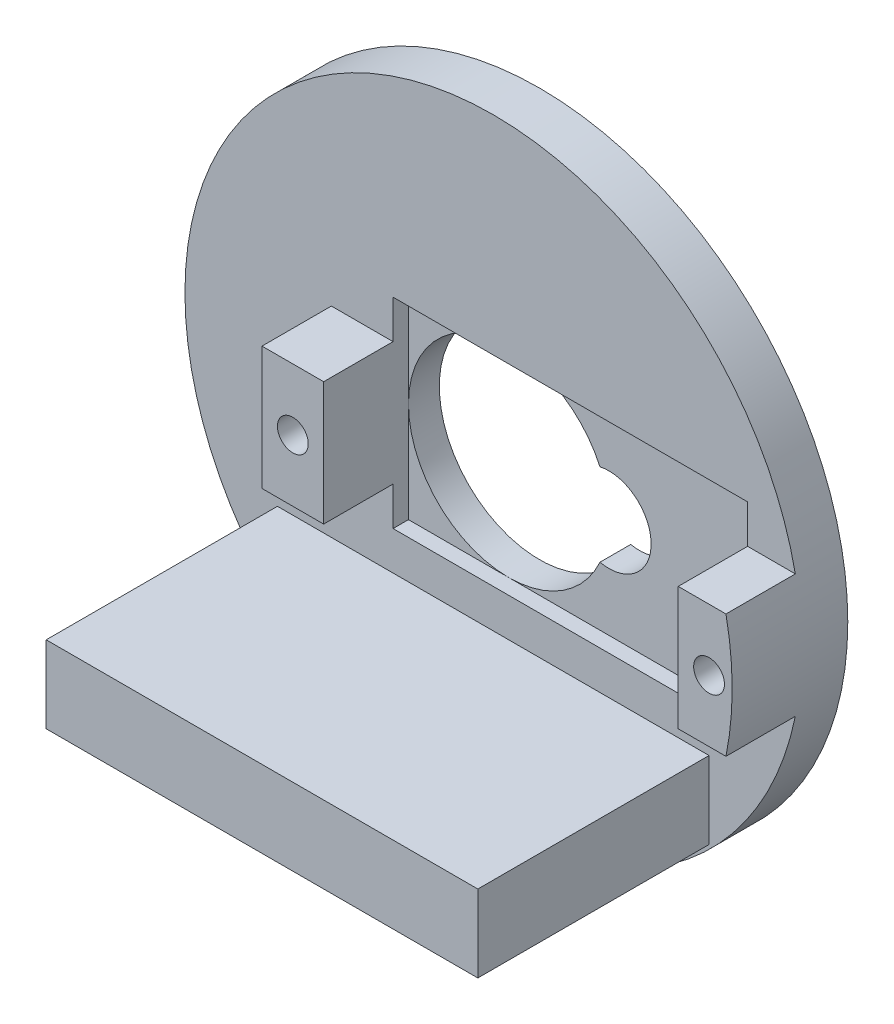
ISO-10303-21;
HEADER;
FILE_DESCRIPTION(('STEP AP214'),'2;1');
FILE_NAME('part.step','',(''),(''),'','','');
FILE_SCHEMA(('AUTOMOTIVE_DESIGN { 1 0 10303 214 1 1 1 1 }'));
ENDSEC;
DATA;
#1=APPLICATION_CONTEXT('core data for automotive mechanical design processes');
#2=APPLICATION_PROTOCOL_DEFINITION('international standard','automotive_design',2000,#1);
#3=PRODUCT_CONTEXT('',#1,'mechanical');
#4=PRODUCT('Part','Part','',(#3));
#5=PRODUCT_RELATED_PRODUCT_CATEGORY('part','',(#4));
#6=PRODUCT_DEFINITION_FORMATION('','',#4);
#7=PRODUCT_DEFINITION_CONTEXT('part definition',#1,'design');
#8=PRODUCT_DEFINITION('design','',#6,#7);
#9=PRODUCT_DEFINITION_SHAPE('','',#8);
#10=(LENGTH_UNIT() NAMED_UNIT(*) SI_UNIT(.MILLI.,.METRE.));
#11=(NAMED_UNIT(*) PLANE_ANGLE_UNIT() SI_UNIT($,.RADIAN.));
#12=(NAMED_UNIT(*) SI_UNIT($,.STERADIAN.) SOLID_ANGLE_UNIT());
#13=UNCERTAINTY_MEASURE_WITH_UNIT(LENGTH_MEASURE(1.E-05),#10,'distance_accuracy_value','');
#14=(GEOMETRIC_REPRESENTATION_CONTEXT(3) GLOBAL_UNCERTAINTY_ASSIGNED_CONTEXT((#13)) GLOBAL_UNIT_ASSIGNED_CONTEXT((#10,
#11,#12)) REPRESENTATION_CONTEXT('',''));
#15=CARTESIAN_POINT('',(0.,0.,0.));
#16=DIRECTION('',(0.,0.,1.));
#17=DIRECTION('',(1.,0.,0.));
#18=AXIS2_PLACEMENT_3D('',#15,#16,#17);
#19=CARTESIAN_POINT('',(0.,0.,3.));
#20=DIRECTION('',(0.,0.,1.));
#21=DIRECTION('',(1.,0.,0.));
#22=AXIS2_PLACEMENT_3D('',#19,#20,#21);
#23=PLANE('',#22);
#24=DIRECTION('',(0.,1.,0.));
#25=VECTOR('',#24,1.);
#26=CARTESIAN_POINT('',(16.5,-6.5,3.));
#27=LINE('',#26,#25);
#28=CARTESIAN_POINT('',(16.5,-6.5,3.));
#29=VERTEX_POINT('',#28);
#30=CARTESIAN_POINT('',(16.5,-4.,3.));
#31=VERTEX_POINT('',#30);
#32=EDGE_CURVE('E193',#29,#31,#27,.T.);
#33=ORIENTED_EDGE('',*,*,#32,.F.);
#34=DIRECTION('',(1.,0.,0.));
#35=VECTOR('',#34,1.);
#36=CARTESIAN_POINT('',(-6.5,-6.5,3.));
#37=LINE('',#36,#35);
#38=CARTESIAN_POINT('',(-6.5,-6.5,3.));
#39=VERTEX_POINT('',#38);
#40=EDGE_CURVE('E202',#39,#29,#37,.T.);
#41=ORIENTED_EDGE('',*,*,#40,.F.);
#42=DIRECTION('',(0.,-1.,0.));
#43=VECTOR('',#42,1.);
#44=CARTESIAN_POINT('',(-6.5,-6.5,3.));
#45=LINE('',#44,#43);
#46=CARTESIAN_POINT('',(-6.5,-4.,3.));
#47=VERTEX_POINT('',#46);
#48=EDGE_CURVE('E215',#47,#39,#45,.T.);
#49=ORIENTED_EDGE('',*,*,#48,.F.);
#50=DIRECTION('',(1.,0.,0.));
#51=VECTOR('',#50,1.);
#52=CARTESIAN_POINT('',(-10.5,-4.,3.));
#53=LINE('',#52,#51);
#54=CARTESIAN_POINT('',(-10.5,-4.,3.));
#55=VERTEX_POINT('',#54);
#56=EDGE_CURVE('E273',#55,#47,#53,.T.);
#57=ORIENTED_EDGE('',*,*,#56,.F.);
#58=DIRECTION('',(0.,-1.,0.));
#59=VECTOR('',#58,1.);
#60=CARTESIAN_POINT('',(-10.5,-4.,3.));
#61=LINE('',#60,#59);
#62=CARTESIAN_POINT('',(-10.5,4.,3.));
#63=VERTEX_POINT('',#62);
#64=EDGE_CURVE('E282',#63,#55,#61,.T.);
#65=ORIENTED_EDGE('',*,*,#64,.F.);
#66=DIRECTION('',(-1.,0.,0.));
#67=VECTOR('',#66,1.);
#68=CARTESIAN_POINT('',(-10.5,4.,3.));
#69=LINE('',#68,#67);
#70=CARTESIAN_POINT('',(-6.50000000000001,4.,3.));
#71=VERTEX_POINT('',#70);
#72=EDGE_CURVE('E266',#71,#63,#69,.T.);
#73=ORIENTED_EDGE('',*,*,#72,.F.);
#74=CARTESIAN_POINT('',(-6.50000000000001,6.5,3.));
#75=VERTEX_POINT('',#74);
#76=EDGE_CURVE('E216',#75,#71,#45,.T.);
#77=ORIENTED_EDGE('',*,*,#76,.F.);
#78=DIRECTION('',(-1.,0.,0.));
#79=VECTOR('',#78,1.);
#80=CARTESIAN_POINT('',(-6.50000000000001,6.5,3.));
#81=LINE('',#80,#79);
#82=CARTESIAN_POINT('',(16.5,6.5,3.));
#83=VERTEX_POINT('',#82);
#84=EDGE_CURVE('E213',#83,#75,#81,.T.);
#85=ORIENTED_EDGE('',*,*,#84,.F.);
#86=CARTESIAN_POINT('',(16.5,4.,3.));
#87=VERTEX_POINT('',#86);
#88=EDGE_CURVE('E191',#87,#83,#27,.T.);
#89=ORIENTED_EDGE('',*,*,#88,.F.);
#90=DIRECTION('',(-1.,0.,0.));
#91=VECTOR('',#90,1.);
#92=CARTESIAN_POINT('',(16.5,4.,3.));
#93=LINE('',#92,#91);
#94=CARTESIAN_POINT('',(19.5959179422654,4.,3.));
#95=VERTEX_POINT('',#94);
#96=EDGE_CURVE('E235',#95,#87,#93,.T.);
#97=ORIENTED_EDGE('',*,*,#96,.F.);
#98=CARTESIAN_POINT('',(0.,0.,3.));
#99=DIRECTION('',(0.,0.,1.));
#100=DIRECTION('',(1.,0.,0.));
#101=AXIS2_PLACEMENT_3D('',#98,#99,#100);
#102=CIRCLE('',#101,20.);
#103=CARTESIAN_POINT('',(19.5959179422654,-4.,3.));
#104=VERTEX_POINT('',#103);
#105=EDGE_CURVE('E309',#95,#104,#102,.T.);
#106=ORIENTED_EDGE('',*,*,#105,.T.);
#107=DIRECTION('',(1.,0.,0.));
#108=VECTOR('',#107,1.);
#109=CARTESIAN_POINT('',(16.5,-4.,3.));
#110=LINE('',#109,#108);
#111=EDGE_CURVE('E240',#31,#104,#110,.T.);
#112=ORIENTED_EDGE('',*,*,#111,.F.);
#113=EDGE_LOOP('',(#33,#41,#49,#57,#65,#73,#77,#85,#89,#97,#106,#112));
#114=FACE_BOUND('',#113,.T.);
#115=DIRECTION('',(-1.,0.,0.));
#116=VECTOR('',#115,1.);
#117=CARTESIAN_POINT('',(-14.,-9.,3.));
#118=LINE('',#117,#116);
#119=CARTESIAN_POINT('',(14.,-9.,3.));
#120=VERTEX_POINT('',#119);
#121=CARTESIAN_POINT('',(-14.,-9.,3.));
#122=VERTEX_POINT('',#121);
#123=EDGE_CURVE('E618',#120,#122,#118,.T.);
#124=ORIENTED_EDGE('',*,*,#123,.F.);
#125=DIRECTION('',(0.,1.,0.));
#126=VECTOR('',#125,1.);
#127=CARTESIAN_POINT('',(14.,-14.,3.));
#128=LINE('',#127,#126);
#129=CARTESIAN_POINT('',(14.,-14.,3.));
#130=VERTEX_POINT('',#129);
#131=EDGE_CURVE('E189',#130,#120,#128,.T.);
#132=ORIENTED_EDGE('',*,*,#131,.F.);
#133=DIRECTION('',(1.,0.,0.));
#134=VECTOR('',#133,1.);
#135=CARTESIAN_POINT('',(-14.,-14.,3.));
#136=LINE('',#135,#134);
#137=CARTESIAN_POINT('',(-14.,-14.,3.));
#138=VERTEX_POINT('',#137);
#139=EDGE_CURVE('E185',#138,#130,#136,.T.);
#140=ORIENTED_EDGE('',*,*,#139,.F.);
#141=DIRECTION('',(0.,-1.,0.));
#142=VECTOR('',#141,1.);
#143=CARTESIAN_POINT('',(-14.,-14.,3.));
#144=LINE('',#143,#142);
#145=EDGE_CURVE('E615',#122,#138,#144,.T.);
#146=ORIENTED_EDGE('',*,*,#145,.F.);
#147=EDGE_LOOP('',(#124,#132,#140,#146));
#148=FACE_BOUND('',#147,.T.);
#149=ADVANCED_FACE('F32',(#114,#148),#23,.T.);
#150=CARTESIAN_POINT('',(0.,0.,3.));
#151=DIRECTION('',(0.,0.,-1.));
#152=DIRECTION('',(-1.,0.,0.));
#153=AXIS2_PLACEMENT_3D('',#150,#151,#152);
#154=CYLINDRICAL_SURFACE('',#153,6.5);
#155=CARTESIAN_POINT('',(0.,0.,2.));
#156=DIRECTION('',(0.,0.,-1.));
#157=DIRECTION('',(-1.,0.,0.));
#158=AXIS2_PLACEMENT_3D('',#155,#156,#157);
#159=CIRCLE('',#158,6.5);
#160=CARTESIAN_POINT('',(0.,6.5,2.));
#161=VERTEX_POINT('',#160);
#162=CARTESIAN_POINT('',(5.9213890224145,2.6808864290061,2.));
#163=VERTEX_POINT('',#162);
#164=EDGE_CURVE('E11',#161,#163,#159,.T.);
#165=ORIENTED_EDGE('',*,*,#164,.F.);
#166=CARTESIAN_POINT('',(-6.5,0.,2.));
#167=VERTEX_POINT('',#166);
#168=EDGE_CURVE('E41',#167,#161,#159,.T.);
#169=ORIENTED_EDGE('',*,*,#168,.F.);
#170=CARTESIAN_POINT('',(0.,-6.5,2.));
#171=VERTEX_POINT('',#170);
#172=EDGE_CURVE('E36',#171,#167,#159,.T.);
#173=ORIENTED_EDGE('',*,*,#172,.F.);
#174=CARTESIAN_POINT('',(5.9213890224145,-2.6808864290061,2.));
#175=VERTEX_POINT('',#174);
#176=EDGE_CURVE('E316',#175,#171,#159,.T.);
#177=ORIENTED_EDGE('',*,*,#176,.F.);
#178=DIRECTION('',(0.,0.,-1.));
#179=VECTOR('',#178,1.);
#180=CARTESIAN_POINT('',(5.9213890224145,-2.6808864290061,3.));
#181=LINE('',#180,#179);
#182=CARTESIAN_POINT('',(5.9213890224145,-2.6808864290061,0.));
#183=VERTEX_POINT('',#182);
#184=EDGE_CURVE('E304',#175,#183,#181,.T.);
#185=ORIENTED_EDGE('',*,*,#184,.T.);
#186=CARTESIAN_POINT('',(0.,0.,0.));
#187=DIRECTION('',(0.,0.,1.));
#188=DIRECTION('',(1.,0.,0.));
#189=AXIS2_PLACEMENT_3D('',#186,#187,#188);
#190=CIRCLE('',#189,6.5);
#191=CARTESIAN_POINT('',(5.9213890224145,2.6808864290061,0.));
#192=VERTEX_POINT('',#191);
#193=EDGE_CURVE('E301',#192,#183,#190,.T.);
#194=ORIENTED_EDGE('',*,*,#193,.F.);
#195=DIRECTION('',(0.,0.,-1.));
#196=VECTOR('',#195,1.);
#197=CARTESIAN_POINT('',(5.9213890224145,2.6808864290061,3.));
#198=LINE('',#197,#196);
#199=EDGE_CURVE('E306',#163,#192,#198,.T.);
#200=ORIENTED_EDGE('',*,*,#199,.F.);
#201=EDGE_LOOP('',(#165,#169,#173,#177,#185,#194,#200));
#202=FACE_BOUND('',#201,.T.);
#203=ADVANCED_FACE('F337',(#202),#154,.F.);
#204=CARTESIAN_POINT('',(0.,0.,0.));
#205=DIRECTION('',(0.,0.,1.));
#206=DIRECTION('',(1.,0.,0.));
#207=AXIS2_PLACEMENT_3D('',#204,#205,#206);
#208=PLANE('',#207);
#209=CARTESIAN_POINT('',(0.,0.,0.));
#210=DIRECTION('',(0.,0.,1.));
#211=DIRECTION('',(1.,0.,0.));
#212=AXIS2_PLACEMENT_3D('',#209,#210,#211);
#213=CIRCLE('',#212,20.);
#214=CARTESIAN_POINT('',(20.,0.,0.));
#215=VERTEX_POINT('',#214);
#216=EDGE_CURVE('E308',#215,#215,#213,.T.);
#217=ORIENTED_EDGE('',*,*,#216,.F.);
#218=EDGE_LOOP('',(#217));
#219=FACE_BOUND('',#218,.T.);
#220=CARTESIAN_POINT('',(6.5,0.,0.));
#221=DIRECTION('',(0.,0.,1.));
#222=DIRECTION('',(1.,0.,0.));
#223=AXIS2_PLACEMENT_3D('',#220,#221,#222);
#224=CIRCLE('',#223,2.74261603375527);
#225=EDGE_CURVE('E298',#183,#192,#224,.T.);
#226=ORIENTED_EDGE('',*,*,#225,.T.);
#227=ORIENTED_EDGE('',*,*,#193,.T.);
#228=EDGE_LOOP('',(#226,#227));
#229=FACE_BOUND('',#228,.T.);
#230=ADVANCED_FACE('F344',(#219,#229),#208,.F.);
#231=CARTESIAN_POINT('',(0.,0.,3.));
#232=DIRECTION('',(0.,0.,-1.));
#233=DIRECTION('',(-1.,0.,0.));
#234=AXIS2_PLACEMENT_3D('',#231,#232,#233);
#235=CYLINDRICAL_SURFACE('',#234,20.);
#236=ORIENTED_EDGE('',*,*,#105,.F.);
#237=DIRECTION('',(0.,0.,-1.));
#238=VECTOR('',#237,1.);
#239=CARTESIAN_POINT('',(19.5959179422654,4.,7.5));
#240=LINE('',#239,#238);
#241=CARTESIAN_POINT('',(19.5959179422654,4.,7.5));
#242=VERTEX_POINT('',#241);
#243=EDGE_CURVE('E259',#242,#95,#240,.T.);
#244=ORIENTED_EDGE('',*,*,#243,.F.);
#245=CARTESIAN_POINT('',(0.,0.,7.5));
#246=DIRECTION('',(0.,0.,1.));
#247=DIRECTION('',(1.,0.,0.));
#248=AXIS2_PLACEMENT_3D('',#245,#246,#247);
#249=CIRCLE('',#248,20.);
#250=CARTESIAN_POINT('',(19.5959179422654,-4.,7.5));
#251=VERTEX_POINT('',#250);
#252=EDGE_CURVE('E236',#251,#242,#249,.T.);
#253=ORIENTED_EDGE('',*,*,#252,.F.);
#254=DIRECTION('',(0.,0.,-1.));
#255=VECTOR('',#254,1.);
#256=CARTESIAN_POINT('',(19.5959179422654,-4.,7.5));
#257=LINE('',#256,#255);
#258=EDGE_CURVE('E246',#251,#104,#257,.T.);
#259=ORIENTED_EDGE('',*,*,#258,.T.);
#260=EDGE_LOOP('',(#236,#244,#253,#259));
#261=FACE_BOUND('',#260,.T.);
#262=ORIENTED_EDGE('',*,*,#216,.T.);
#263=EDGE_LOOP('',(#262));
#264=FACE_BOUND('',#263,.T.);
#265=ADVANCED_FACE('F34',(#261,#264),#235,.T.);
#266=CARTESIAN_POINT('',(6.5,0.,3.));
#267=DIRECTION('',(0.,0.,-1.));
#268=DIRECTION('',(-1.,0.,0.));
#269=AXIS2_PLACEMENT_3D('',#266,#267,#268);
#270=CYLINDRICAL_SURFACE('',#269,2.74261603375527);
#271=CARTESIAN_POINT('',(6.5,0.,2.));
#272=DIRECTION('',(0.,0.,-1.));
#273=DIRECTION('',(-1.,0.,0.));
#274=AXIS2_PLACEMENT_3D('',#271,#272,#273);
#275=CIRCLE('',#274,2.74261603375527);
#276=EDGE_CURVE('E222',#163,#175,#275,.T.);
#277=ORIENTED_EDGE('',*,*,#276,.F.);
#278=ORIENTED_EDGE('',*,*,#199,.T.);
#279=ORIENTED_EDGE('',*,*,#225,.F.);
#280=ORIENTED_EDGE('',*,*,#184,.F.);
#281=EDGE_LOOP('',(#277,#278,#279,#280));
#282=FACE_BOUND('',#281,.T.);
#283=ADVANCED_FACE('F341',(#282),#270,.F.);
#284=CARTESIAN_POINT('',(0.,0.,7.5));
#285=DIRECTION('',(0.,0.,-1.));
#286=DIRECTION('',(-1.,0.,0.));
#287=AXIS2_PLACEMENT_3D('',#284,#285,#286);
#288=PLANE('',#287);
#289=DIRECTION('',(0.,1.,0.));
#290=VECTOR('',#289,1.);
#291=CARTESIAN_POINT('',(-6.5,-4.,7.5));
#292=LINE('',#291,#290);
#293=CARTESIAN_POINT('',(-6.5,-4.,7.5));
#294=VERTEX_POINT('',#293);
#295=CARTESIAN_POINT('',(-6.5,4.,7.5));
#296=VERTEX_POINT('',#295);
#297=EDGE_CURVE('E269',#294,#296,#292,.T.);
#298=ORIENTED_EDGE('',*,*,#297,.T.);
#299=DIRECTION('',(-1.,0.,0.));
#300=VECTOR('',#299,1.);
#301=CARTESIAN_POINT('',(-10.5,4.,7.5));
#302=LINE('',#301,#300);
#303=CARTESIAN_POINT('',(-10.5,4.,7.5));
#304=VERTEX_POINT('',#303);
#305=EDGE_CURVE('E272',#296,#304,#302,.T.);
#306=ORIENTED_EDGE('',*,*,#305,.T.);
#307=DIRECTION('',(0.,-1.,0.));
#308=VECTOR('',#307,1.);
#309=CARTESIAN_POINT('',(-10.5,-4.,7.5));
#310=LINE('',#309,#308);
#311=CARTESIAN_POINT('',(-10.5,-4.,7.5));
#312=VERTEX_POINT('',#311);
#313=EDGE_CURVE('E275',#304,#312,#310,.T.);
#314=ORIENTED_EDGE('',*,*,#313,.T.);
#315=DIRECTION('',(1.,0.,0.));
#316=VECTOR('',#315,1.);
#317=CARTESIAN_POINT('',(-10.5,-4.,7.5));
#318=LINE('',#317,#316);
#319=EDGE_CURVE('E277',#312,#294,#318,.T.);
#320=ORIENTED_EDGE('',*,*,#319,.T.);
#321=EDGE_LOOP('',(#298,#306,#314,#320));
#322=FACE_BOUND('',#321,.T.);
#323=CARTESIAN_POINT('',(-8.5,0.,7.5));
#324=DIRECTION('',(0.,0.,1.));
#325=DIRECTION('',(1.,0.,0.));
#326=AXIS2_PLACEMENT_3D('',#323,#324,#325);
#327=CIRCLE('',#326,1.);
#328=CARTESIAN_POINT('',(-7.5,0.,7.5));
#329=VERTEX_POINT('',#328);
#330=EDGE_CURVE('E263',#329,#329,#327,.T.);
#331=ORIENTED_EDGE('',*,*,#330,.F.);
#332=EDGE_LOOP('',(#331));
#333=FACE_BOUND('',#332,.T.);
#334=ADVANCED_FACE('F393',(#322,#333),#288,.F.);
#335=CARTESIAN_POINT('',(-6.5,-4.,7.5));
#336=DIRECTION('',(-1.,0.,0.));
#337=DIRECTION('',(0.,0.,1.));
#338=AXIS2_PLACEMENT_3D('',#335,#336,#337);
#339=PLANE('',#338);
#340=DIRECTION('',(0.,-1.,0.));
#341=VECTOR('',#340,1.);
#342=CARTESIAN_POINT('',(-6.5,-6.5,2.));
#343=LINE('',#342,#341);
#344=CARTESIAN_POINT('',(-6.5,-6.5,2.));
#345=VERTEX_POINT('',#344);
#346=EDGE_CURVE('E206',#167,#345,#343,.T.);
#347=ORIENTED_EDGE('',*,*,#346,.F.);
#348=CARTESIAN_POINT('',(-6.50000000000001,6.5,2.));
#349=VERTEX_POINT('',#348);
#350=EDGE_CURVE('E207',#349,#167,#343,.T.);
#351=ORIENTED_EDGE('',*,*,#350,.F.);
#352=DIRECTION('',(0.,0.,1.));
#353=VECTOR('',#352,1.);
#354=CARTESIAN_POINT('',(-6.50000000000001,6.5,2.));
#355=LINE('',#354,#353);
#356=EDGE_CURVE('E226',#349,#75,#355,.T.);
#357=ORIENTED_EDGE('',*,*,#356,.T.);
#358=ORIENTED_EDGE('',*,*,#76,.T.);
#359=DIRECTION('',(0.,0.,-1.));
#360=VECTOR('',#359,1.);
#361=CARTESIAN_POINT('',(-6.5,4.,7.5));
#362=LINE('',#361,#360);
#363=EDGE_CURVE('E295',#296,#71,#362,.T.);
#364=ORIENTED_EDGE('',*,*,#363,.F.);
#365=ORIENTED_EDGE('',*,*,#297,.F.);
#366=DIRECTION('',(0.,0.,-1.));
#367=VECTOR('',#366,1.);
#368=CARTESIAN_POINT('',(-6.5,-4.,7.5));
#369=LINE('',#368,#367);
#370=EDGE_CURVE('E279',#294,#47,#369,.T.);
#371=ORIENTED_EDGE('',*,*,#370,.T.);
#372=ORIENTED_EDGE('',*,*,#48,.T.);
#373=DIRECTION('',(0.,0.,1.));
#374=VECTOR('',#373,1.);
#375=CARTESIAN_POINT('',(-6.5,-6.5,2.));
#376=LINE('',#375,#374);
#377=EDGE_CURVE('E223',#345,#39,#376,.T.);
#378=ORIENTED_EDGE('',*,*,#377,.F.);
#379=EDGE_LOOP('',(#347,#351,#357,#358,#364,#365,#371,#372,#378));
#380=FACE_BOUND('',#379,.T.);
#381=ADVANCED_FACE('F395',(#380),#339,.F.);
#382=CARTESIAN_POINT('',(-10.5,4.,7.5));
#383=DIRECTION('',(0.,-1.,0.));
#384=DIRECTION('',(0.,0.,-1.));
#385=AXIS2_PLACEMENT_3D('',#382,#383,#384);
#386=PLANE('',#385);
#387=ORIENTED_EDGE('',*,*,#72,.T.);
#388=DIRECTION('',(0.,0.,-1.));
#389=VECTOR('',#388,1.);
#390=CARTESIAN_POINT('',(-10.5,4.,7.5));
#391=LINE('',#390,#389);
#392=EDGE_CURVE('E292',#304,#63,#391,.T.);
#393=ORIENTED_EDGE('',*,*,#392,.F.);
#394=ORIENTED_EDGE('',*,*,#305,.F.);
#395=ORIENTED_EDGE('',*,*,#363,.T.);
#396=EDGE_LOOP('',(#387,#393,#394,#395));
#397=FACE_BOUND('',#396,.T.);
#398=ADVANCED_FACE('F400',(#397),#386,.F.);
#399=CARTESIAN_POINT('',(-10.5,-4.,7.5));
#400=DIRECTION('',(1.,0.,0.));
#401=DIRECTION('',(0.,0.,-1.));
#402=AXIS2_PLACEMENT_3D('',#399,#400,#401);
#403=PLANE('',#402);
#404=ORIENTED_EDGE('',*,*,#64,.T.);
#405=DIRECTION('',(0.,0.,-1.));
#406=VECTOR('',#405,1.);
#407=CARTESIAN_POINT('',(-10.5,-4.,7.5));
#408=LINE('',#407,#406);
#409=EDGE_CURVE('E289',#312,#55,#408,.T.);
#410=ORIENTED_EDGE('',*,*,#409,.F.);
#411=ORIENTED_EDGE('',*,*,#313,.F.);
#412=ORIENTED_EDGE('',*,*,#392,.T.);
#413=EDGE_LOOP('',(#404,#410,#411,#412));
#414=FACE_BOUND('',#413,.T.);
#415=ADVANCED_FACE('F387',(#414),#403,.F.);
#416=CARTESIAN_POINT('',(-10.5,-4.,7.5));
#417=DIRECTION('',(0.,1.,0.));
#418=DIRECTION('',(0.,0.,1.));
#419=AXIS2_PLACEMENT_3D('',#416,#417,#418);
#420=PLANE('',#419);
#421=ORIENTED_EDGE('',*,*,#56,.T.);
#422=ORIENTED_EDGE('',*,*,#370,.F.);
#423=ORIENTED_EDGE('',*,*,#319,.F.);
#424=ORIENTED_EDGE('',*,*,#409,.T.);
#425=EDGE_LOOP('',(#421,#422,#423,#424));
#426=FACE_BOUND('',#425,.T.);
#427=ADVANCED_FACE('F379',(#426),#420,.F.);
#428=CARTESIAN_POINT('',(-8.5,0.,7.5));
#429=DIRECTION('',(0.,0.,-1.));
#430=DIRECTION('',(-1.,0.,0.));
#431=AXIS2_PLACEMENT_3D('',#428,#429,#430);
#432=CYLINDRICAL_SURFACE('',#431,1.);
#433=ORIENTED_EDGE('',*,*,#330,.T.);
#434=EDGE_LOOP('',(#433));
#435=FACE_BOUND('',#434,.T.);
#436=CARTESIAN_POINT('',(-8.5,0.,3.));
#437=DIRECTION('',(0.,0.,1.));
#438=DIRECTION('',(1.,0.,0.));
#439=AXIS2_PLACEMENT_3D('',#436,#437,#438);
#440=CIRCLE('',#439,1.);
#441=CARTESIAN_POINT('',(-7.5,0.,3.));
#442=VERTEX_POINT('',#441);
#443=EDGE_CURVE('E262',#442,#442,#440,.T.);
#444=ORIENTED_EDGE('',*,*,#443,.F.);
#445=EDGE_LOOP('',(#444));
#446=FACE_BOUND('',#445,.T.);
#447=ADVANCED_FACE('F370',(#435,#446),#432,.F.);
#448=ORIENTED_EDGE('',*,*,#443,.T.);
#449=EDGE_LOOP('',(#448));
#450=FACE_BOUND('',#449,.T.);
#451=ADVANCED_FACE('F358',(#450),#23,.T.);
#452=CARTESIAN_POINT('',(0.,0.,7.5));
#453=DIRECTION('',(0.,0.,1.));
#454=DIRECTION('',(1.,0.,0.));
#455=AXIS2_PLACEMENT_3D('',#452,#453,#454);
#456=PLANE('',#455);
#457=ORIENTED_EDGE('',*,*,#252,.T.);
#458=DIRECTION('',(-1.,0.,0.));
#459=VECTOR('',#458,1.);
#460=CARTESIAN_POINT('',(16.5,4.,7.5));
#461=LINE('',#460,#459);
#462=CARTESIAN_POINT('',(16.5,4.,7.5));
#463=VERTEX_POINT('',#462);
#464=EDGE_CURVE('E239',#242,#463,#461,.T.);
#465=ORIENTED_EDGE('',*,*,#464,.T.);
#466=DIRECTION('',(0.,-1.,0.));
#467=VECTOR('',#466,1.);
#468=CARTESIAN_POINT('',(16.5,-4.,7.5));
#469=LINE('',#468,#467);
#470=CARTESIAN_POINT('',(16.5,-4.,7.5));
#471=VERTEX_POINT('',#470);
#472=EDGE_CURVE('E242',#463,#471,#469,.T.);
#473=ORIENTED_EDGE('',*,*,#472,.T.);
#474=DIRECTION('',(1.,0.,0.));
#475=VECTOR('',#474,1.);
#476=CARTESIAN_POINT('',(16.5,-4.,7.5));
#477=LINE('',#476,#475);
#478=EDGE_CURVE('E244',#471,#251,#477,.T.);
#479=ORIENTED_EDGE('',*,*,#478,.T.);
#480=EDGE_LOOP('',(#457,#465,#473,#479));
#481=FACE_BOUND('',#480,.T.);
#482=CARTESIAN_POINT('',(18.5,0.,7.5));
#483=DIRECTION('',(0.,0.,1.));
#484=DIRECTION('',(1.,0.,0.));
#485=AXIS2_PLACEMENT_3D('',#482,#483,#484);
#486=CIRCLE('',#485,1.);
#487=CARTESIAN_POINT('',(19.5,0.,7.5));
#488=VERTEX_POINT('',#487);
#489=EDGE_CURVE('E232',#488,#488,#486,.T.);
#490=ORIENTED_EDGE('',*,*,#489,.F.);
#491=EDGE_LOOP('',(#490));
#492=FACE_BOUND('',#491,.T.);
#493=ADVANCED_FACE('F369',(#481,#492),#456,.T.);
#494=CARTESIAN_POINT('',(16.5,4.,7.5));
#495=DIRECTION('',(0.,-1.,0.));
#496=DIRECTION('',(1.,0.,0.));
#497=AXIS2_PLACEMENT_3D('',#494,#495,#496);
#498=PLANE('',#497);
#499=ORIENTED_EDGE('',*,*,#96,.T.);
#500=DIRECTION('',(0.,0.,-1.));
#501=VECTOR('',#500,1.);
#502=CARTESIAN_POINT('',(16.5,4.,7.5));
#503=LINE('',#502,#501);
#504=EDGE_CURVE('E256',#463,#87,#503,.T.);
#505=ORIENTED_EDGE('',*,*,#504,.F.);
#506=ORIENTED_EDGE('',*,*,#464,.F.);
#507=ORIENTED_EDGE('',*,*,#243,.T.);
#508=EDGE_LOOP('',(#499,#505,#506,#507));
#509=FACE_BOUND('',#508,.T.);
#510=ADVANCED_FACE('F376',(#509),#498,.F.);
#511=CARTESIAN_POINT('',(16.5,-4.,7.5));
#512=DIRECTION('',(1.,0.,0.));
#513=DIRECTION('',(0.,0.,-1.));
#514=AXIS2_PLACEMENT_3D('',#511,#512,#513);
#515=PLANE('',#514);
#516=ORIENTED_EDGE('',*,*,#504,.T.);
#517=ORIENTED_EDGE('',*,*,#88,.T.);
#518=DIRECTION('',(0.,0.,1.));
#519=VECTOR('',#518,1.);
#520=CARTESIAN_POINT('',(16.5,6.5,2.));
#521=LINE('',#520,#519);
#522=CARTESIAN_POINT('',(16.5,6.5,2.));
#523=VERTEX_POINT('',#522);
#524=EDGE_CURVE('E211',#523,#83,#521,.T.);
#525=ORIENTED_EDGE('',*,*,#524,.F.);
#526=DIRECTION('',(0.,1.,0.));
#527=VECTOR('',#526,1.);
#528=CARTESIAN_POINT('',(16.5,-6.5,2.));
#529=LINE('',#528,#527);
#530=CARTESIAN_POINT('',(16.5,-6.5,2.));
#531=VERTEX_POINT('',#530);
#532=EDGE_CURVE('E198',#531,#523,#529,.T.);
#533=ORIENTED_EDGE('',*,*,#532,.F.);
#534=DIRECTION('',(0.,0.,1.));
#535=VECTOR('',#534,1.);
#536=CARTESIAN_POINT('',(16.5,-6.5,2.));
#537=LINE('',#536,#535);
#538=EDGE_CURVE('E219',#531,#29,#537,.T.);
#539=ORIENTED_EDGE('',*,*,#538,.T.);
#540=ORIENTED_EDGE('',*,*,#32,.T.);
#541=DIRECTION('',(0.,0.,-1.));
#542=VECTOR('',#541,1.);
#543=CARTESIAN_POINT('',(16.5,-4.,7.5));
#544=LINE('',#543,#542);
#545=EDGE_CURVE('E253',#471,#31,#544,.T.);
#546=ORIENTED_EDGE('',*,*,#545,.F.);
#547=ORIENTED_EDGE('',*,*,#472,.F.);
#548=EDGE_LOOP('',(#516,#517,#525,#533,#539,#540,#546,#547));
#549=FACE_BOUND('',#548,.T.);
#550=ADVANCED_FACE('F443',(#549),#515,.F.);
#551=CARTESIAN_POINT('',(16.5,-4.,7.5));
#552=DIRECTION('',(0.,1.,0.));
#553=DIRECTION('',(-1.,0.,0.));
#554=AXIS2_PLACEMENT_3D('',#551,#552,#553);
#555=PLANE('',#554);
#556=ORIENTED_EDGE('',*,*,#111,.T.);
#557=ORIENTED_EDGE('',*,*,#258,.F.);
#558=ORIENTED_EDGE('',*,*,#478,.F.);
#559=ORIENTED_EDGE('',*,*,#545,.T.);
#560=EDGE_LOOP('',(#556,#557,#558,#559));
#561=FACE_BOUND('',#560,.T.);
#562=ADVANCED_FACE('F454',(#561),#555,.F.);
#563=CARTESIAN_POINT('',(18.5,0.,7.5));
#564=DIRECTION('',(0.,0.,-1.));
#565=DIRECTION('',(-1.,0.,0.));
#566=AXIS2_PLACEMENT_3D('',#563,#564,#565);
#567=CYLINDRICAL_SURFACE('',#566,1.);
#568=ORIENTED_EDGE('',*,*,#489,.T.);
#569=EDGE_LOOP('',(#568));
#570=FACE_BOUND('',#569,.T.);
#571=CARTESIAN_POINT('',(18.5,0.,3.));
#572=DIRECTION('',(0.,0.,1.));
#573=DIRECTION('',(1.,0.,0.));
#574=AXIS2_PLACEMENT_3D('',#571,#572,#573);
#575=CIRCLE('',#574,1.);
#576=CARTESIAN_POINT('',(19.5,0.,3.));
#577=VERTEX_POINT('',#576);
#578=EDGE_CURVE('E311',#577,#577,#575,.F.);
#579=ORIENTED_EDGE('',*,*,#578,.T.);
#580=EDGE_LOOP('',(#579));
#581=FACE_BOUND('',#580,.T.);
#582=ADVANCED_FACE('F366',(#570,#581),#567,.F.);
#583=ORIENTED_EDGE('',*,*,#578,.F.);
#584=EDGE_LOOP('',(#583));
#585=FACE_BOUND('',#584,.T.);
#586=ADVANCED_FACE('F357',(#585),#23,.T.);
#587=CARTESIAN_POINT('',(-6.5,-6.5,2.));
#588=DIRECTION('',(0.,-1.,0.));
#589=DIRECTION('',(1.,0.,0.));
#590=AXIS2_PLACEMENT_3D('',#587,#588,#589);
#591=PLANE('',#590);
#592=ORIENTED_EDGE('',*,*,#40,.T.);
#593=ORIENTED_EDGE('',*,*,#538,.F.);
#594=DIRECTION('',(1.,0.,0.));
#595=VECTOR('',#594,1.);
#596=CARTESIAN_POINT('',(-6.5,-6.5,2.));
#597=LINE('',#596,#595);
#598=EDGE_CURVE('E210',#171,#531,#597,.T.);
#599=ORIENTED_EDGE('',*,*,#598,.F.);
#600=EDGE_CURVE('E56',#345,#171,#597,.T.);
#601=ORIENTED_EDGE('',*,*,#600,.F.);
#602=ORIENTED_EDGE('',*,*,#377,.T.);
#603=EDGE_LOOP('',(#592,#593,#599,#601,#602));
#604=FACE_BOUND('',#603,.T.);
#605=ADVANCED_FACE('F365',(#604),#591,.F.);
#606=CARTESIAN_POINT('',(-6.50000000000001,6.5,2.));
#607=DIRECTION('',(0.,1.,0.));
#608=DIRECTION('',(-1.,0.,0.));
#609=AXIS2_PLACEMENT_3D('',#606,#607,#608);
#610=PLANE('',#609);
#611=ORIENTED_EDGE('',*,*,#84,.T.);
#612=ORIENTED_EDGE('',*,*,#356,.F.);
#613=DIRECTION('',(-1.,0.,0.));
#614=VECTOR('',#613,1.);
#615=CARTESIAN_POINT('',(-6.50000000000001,6.5,2.));
#616=LINE('',#615,#614);
#617=EDGE_CURVE('E201',#161,#349,#616,.T.);
#618=ORIENTED_EDGE('',*,*,#617,.F.);
#619=EDGE_CURVE('E203',#523,#161,#616,.T.);
#620=ORIENTED_EDGE('',*,*,#619,.F.);
#621=ORIENTED_EDGE('',*,*,#524,.T.);
#622=EDGE_LOOP('',(#611,#612,#618,#620,#621));
#623=FACE_BOUND('',#622,.T.);
#624=ADVANCED_FACE('F332',(#623),#610,.F.);
#625=CARTESIAN_POINT('',(0.,0.,2.));
#626=DIRECTION('',(0.,0.,-1.));
#627=DIRECTION('',(-1.,0.,0.));
#628=AXIS2_PLACEMENT_3D('',#625,#626,#627);
#629=PLANE('',#628);
#630=ORIENTED_EDGE('',*,*,#164,.T.);
#631=ORIENTED_EDGE('',*,*,#276,.T.);
#632=ORIENTED_EDGE('',*,*,#176,.T.);
#633=ORIENTED_EDGE('',*,*,#598,.T.);
#634=ORIENTED_EDGE('',*,*,#532,.T.);
#635=ORIENTED_EDGE('',*,*,#619,.T.);
#636=EDGE_LOOP('',(#630,#631,#632,#633,#634,#635));
#637=FACE_BOUND('',#636,.T.);
#638=ADVANCED_FACE('F333',(#637),#629,.F.);
#639=ORIENTED_EDGE('',*,*,#168,.T.);
#640=ORIENTED_EDGE('',*,*,#617,.T.);
#641=ORIENTED_EDGE('',*,*,#350,.T.);
#642=EDGE_LOOP('',(#639,#640,#641));
#643=FACE_BOUND('',#642,.T.);
#644=ADVANCED_FACE('F325',(#643),#629,.F.);
#645=ORIENTED_EDGE('',*,*,#172,.T.);
#646=ORIENTED_EDGE('',*,*,#346,.T.);
#647=ORIENTED_EDGE('',*,*,#600,.T.);
#648=EDGE_LOOP('',(#645,#646,#647));
#649=FACE_BOUND('',#648,.T.);
#650=ADVANCED_FACE('F492',(#649),#629,.F.);
#651=CARTESIAN_POINT('',(14.,-14.,18.));
#652=DIRECTION('',(-1.,0.,0.));
#653=DIRECTION('',(0.,0.,1.));
#654=AXIS2_PLACEMENT_3D('',#651,#652,#653);
#655=PLANE('',#654);
#656=ORIENTED_EDGE('',*,*,#131,.T.);
#657=DIRECTION('',(0.,0.,-1.));
#658=VECTOR('',#657,1.);
#659=CARTESIAN_POINT('',(14.,-9.,18.));
#660=LINE('',#659,#658);
#661=CARTESIAN_POINT('',(14.,-9.,18.));
#662=VERTEX_POINT('',#661);
#663=EDGE_CURVE('E170',#662,#120,#660,.T.);
#664=ORIENTED_EDGE('',*,*,#663,.F.);
#665=DIRECTION('',(0.,1.,0.));
#666=VECTOR('',#665,1.);
#667=CARTESIAN_POINT('',(14.,-14.,18.));
#668=LINE('',#667,#666);
#669=CARTESIAN_POINT('',(14.,-14.,18.));
#670=VERTEX_POINT('',#669);
#671=EDGE_CURVE('E177',#670,#662,#668,.T.);
#672=ORIENTED_EDGE('',*,*,#671,.F.);
#673=DIRECTION('',(0.,0.,-1.));
#674=VECTOR('',#673,1.);
#675=CARTESIAN_POINT('',(14.,-14.,18.));
#676=LINE('',#675,#674);
#677=EDGE_CURVE('E613',#670,#130,#676,.T.);
#678=ORIENTED_EDGE('',*,*,#677,.T.);
#679=EDGE_LOOP('',(#656,#664,#672,#678));
#680=FACE_BOUND('',#679,.T.);
#681=ADVANCED_FACE('F187',(#680),#655,.F.);
#682=CARTESIAN_POINT('',(-14.,-9.,18.));
#683=DIRECTION('',(0.,-1.,0.));
#684=DIRECTION('',(1.,0.,0.));
#685=AXIS2_PLACEMENT_3D('',#682,#683,#684);
#686=PLANE('',#685);
#687=ORIENTED_EDGE('',*,*,#123,.T.);
#688=DIRECTION('',(0.,0.,-1.));
#689=VECTOR('',#688,1.);
#690=CARTESIAN_POINT('',(-14.,-9.,18.));
#691=LINE('',#690,#689);
#692=CARTESIAN_POINT('',(-14.,-9.,18.));
#693=VERTEX_POINT('',#692);
#694=EDGE_CURVE('E173',#693,#122,#691,.T.);
#695=ORIENTED_EDGE('',*,*,#694,.F.);
#696=DIRECTION('',(-1.,0.,0.));
#697=VECTOR('',#696,1.);
#698=CARTESIAN_POINT('',(-14.,-9.,18.));
#699=LINE('',#698,#697);
#700=EDGE_CURVE('E166',#662,#693,#699,.T.);
#701=ORIENTED_EDGE('',*,*,#700,.F.);
#702=ORIENTED_EDGE('',*,*,#663,.T.);
#703=EDGE_LOOP('',(#687,#695,#701,#702));
#704=FACE_BOUND('',#703,.T.);
#705=ADVANCED_FACE('F168',(#704),#686,.F.);
#706=CARTESIAN_POINT('',(-14.,-14.,18.));
#707=DIRECTION('',(1.,0.,0.));
#708=DIRECTION('',(0.,0.,-1.));
#709=AXIS2_PLACEMENT_3D('',#706,#707,#708);
#710=PLANE('',#709);
#711=ORIENTED_EDGE('',*,*,#145,.T.);
#712=DIRECTION('',(0.,0.,-1.));
#713=VECTOR('',#712,1.);
#714=CARTESIAN_POINT('',(-14.,-14.,18.));
#715=LINE('',#714,#713);
#716=CARTESIAN_POINT('',(-14.,-14.,18.));
#717=VERTEX_POINT('',#716);
#718=EDGE_CURVE('E48',#717,#138,#715,.T.);
#719=ORIENTED_EDGE('',*,*,#718,.F.);
#720=DIRECTION('',(0.,-1.,0.));
#721=VECTOR('',#720,1.);
#722=CARTESIAN_POINT('',(-14.,-14.,18.));
#723=LINE('',#722,#721);
#724=EDGE_CURVE('E176',#693,#717,#723,.T.);
#725=ORIENTED_EDGE('',*,*,#724,.F.);
#726=ORIENTED_EDGE('',*,*,#694,.T.);
#727=EDGE_LOOP('',(#711,#719,#725,#726));
#728=FACE_BOUND('',#727,.T.);
#729=ADVANCED_FACE('F526',(#728),#710,.F.);
#730=CARTESIAN_POINT('',(-14.,-14.,18.));
#731=DIRECTION('',(0.,1.,0.));
#732=DIRECTION('',(-1.,0.,0.));
#733=AXIS2_PLACEMENT_3D('',#730,#731,#732);
#734=PLANE('',#733);
#735=ORIENTED_EDGE('',*,*,#139,.T.);
#736=ORIENTED_EDGE('',*,*,#677,.F.);
#737=DIRECTION('',(1.,0.,0.));
#738=VECTOR('',#737,1.);
#739=CARTESIAN_POINT('',(-14.,-14.,18.));
#740=LINE('',#739,#738);
#741=EDGE_CURVE('E181',#717,#670,#740,.T.);
#742=ORIENTED_EDGE('',*,*,#741,.F.);
#743=ORIENTED_EDGE('',*,*,#718,.T.);
#744=EDGE_LOOP('',(#735,#736,#742,#743));
#745=FACE_BOUND('',#744,.T.);
#746=ADVANCED_FACE('F535',(#745),#734,.F.);
#747=CARTESIAN_POINT('',(0.,0.,18.));
#748=DIRECTION('',(0.,0.,-1.));
#749=DIRECTION('',(-1.,0.,0.));
#750=AXIS2_PLACEMENT_3D('',#747,#748,#749);
#751=PLANE('',#750);
#752=ORIENTED_EDGE('',*,*,#671,.T.);
#753=ORIENTED_EDGE('',*,*,#700,.T.);
#754=ORIENTED_EDGE('',*,*,#724,.T.);
#755=ORIENTED_EDGE('',*,*,#741,.T.);
#756=EDGE_LOOP('',(#752,#753,#754,#755));
#757=FACE_BOUND('',#756,.T.);
#758=ADVANCED_FACE('F180',(#757),#751,.F.);
#759=CLOSED_SHELL('',(#149,#203,#230,#265,#283,#334,#381,#398,#415,#427,#447,#451,#493,#510,
#550,#562,#582,#586,#605,#624,#638,#644,#650,#681,#705,#729,#746,#758));
#760=MANIFOLD_SOLID_BREP('B2',#759);
#761=ADVANCED_BREP_SHAPE_REPRESENTATION('',(#18,#760),#14);
#762=SHAPE_DEFINITION_REPRESENTATION(#9,#761);
ENDSEC;
END-ISO-10303-21;
